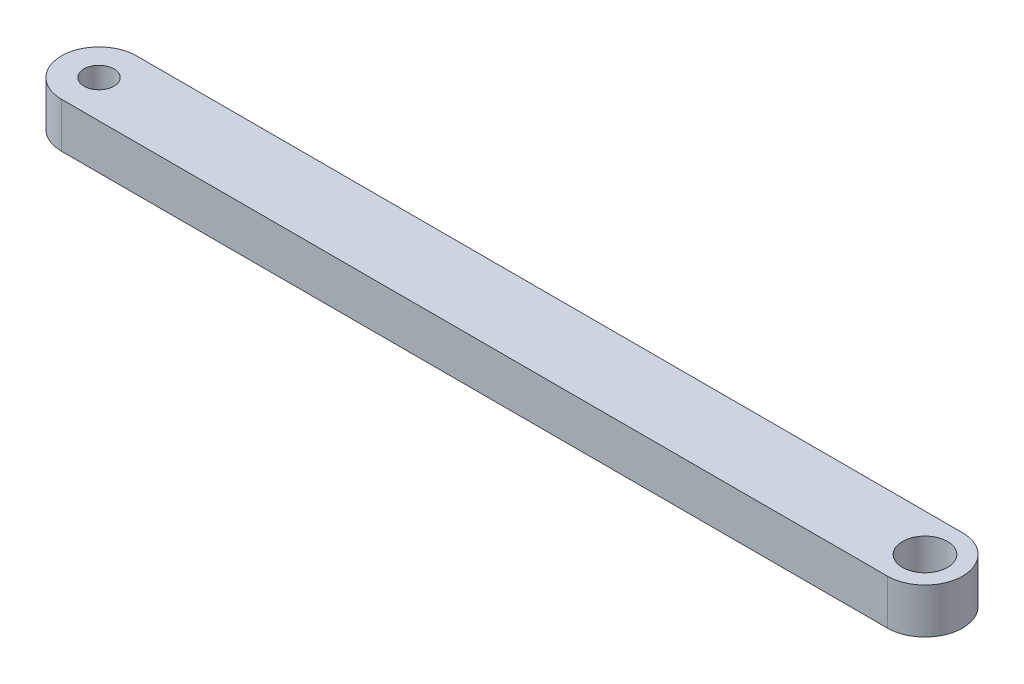
ISO-10303-21;
HEADER;
FILE_DESCRIPTION(('STEP AP214'),'2;1');
FILE_NAME('part.step','',(''),(''),'','','');
FILE_SCHEMA(('AUTOMOTIVE_DESIGN { 1 0 10303 214 1 1 1 1 }'));
ENDSEC;
DATA;
#1=APPLICATION_CONTEXT('core data for automotive mechanical design processes');
#2=APPLICATION_PROTOCOL_DEFINITION('international standard','automotive_design',2000,#1);
#3=PRODUCT_CONTEXT('',#1,'mechanical');
#4=PRODUCT('Part','Part','',(#3));
#5=PRODUCT_RELATED_PRODUCT_CATEGORY('part','',(#4));
#6=PRODUCT_DEFINITION_FORMATION('','',#4);
#7=PRODUCT_DEFINITION_CONTEXT('part definition',#1,'design');
#8=PRODUCT_DEFINITION('design','',#6,#7);
#9=PRODUCT_DEFINITION_SHAPE('','',#8);
#10=(LENGTH_UNIT() NAMED_UNIT(*) SI_UNIT(.MILLI.,.METRE.));
#11=(NAMED_UNIT(*) PLANE_ANGLE_UNIT() SI_UNIT($,.RADIAN.));
#12=(NAMED_UNIT(*) SI_UNIT($,.STERADIAN.) SOLID_ANGLE_UNIT());
#13=UNCERTAINTY_MEASURE_WITH_UNIT(LENGTH_MEASURE(1.E-05),#10,'distance_accuracy_value','');
#14=(GEOMETRIC_REPRESENTATION_CONTEXT(3) GLOBAL_UNCERTAINTY_ASSIGNED_CONTEXT((#13)) GLOBAL_UNIT_ASSIGNED_CONTEXT((#10,
#11,#12)) REPRESENTATION_CONTEXT('',''));
#15=CARTESIAN_POINT('',(0.,0.,0.));
#16=DIRECTION('',(0.,0.,1.));
#17=DIRECTION('',(1.,0.,0.));
#18=AXIS2_PLACEMENT_3D('',#15,#16,#17);
#19=CARTESIAN_POINT('',(46.,3.,0.));
#20=DIRECTION('',(0.,-1.,0.));
#21=DIRECTION('',(0.,0.,-1.));
#22=AXIS2_PLACEMENT_3D('',#19,#20,#21);
#23=CYLINDRICAL_SURFACE('',#22,2.5);
#24=CARTESIAN_POINT('',(46.,0.,0.));
#25=DIRECTION('',(0.,-1.,0.));
#26=DIRECTION('',(0.,0.,-1.));
#27=AXIS2_PLACEMENT_3D('',#24,#25,#26);
#28=CIRCLE('',#27,2.5);
#29=CARTESIAN_POINT('',(46.,0.,-2.5));
#30=VERTEX_POINT('',#29);
#31=CARTESIAN_POINT('',(46.,0.,2.5));
#32=VERTEX_POINT('',#31);
#33=EDGE_CURVE('E98',#30,#32,#28,.T.);
#34=ORIENTED_EDGE('',*,*,#33,.F.);
#35=DIRECTION('',(0.,-1.,0.));
#36=VECTOR('',#35,1.);
#37=CARTESIAN_POINT('',(46.,3.,-2.5));
#38=LINE('',#37,#36);
#39=CARTESIAN_POINT('',(46.,3.,-2.5));
#40=VERTEX_POINT('',#39);
#41=EDGE_CURVE('E11',#40,#30,#38,.T.);
#42=ORIENTED_EDGE('',*,*,#41,.F.);
#43=CARTESIAN_POINT('',(46.,3.,0.));
#44=DIRECTION('',(0.,-1.,0.));
#45=DIRECTION('',(0.,0.,-1.));
#46=AXIS2_PLACEMENT_3D('',#43,#44,#45);
#47=CIRCLE('',#46,2.5);
#48=CARTESIAN_POINT('',(46.,3.,2.5));
#49=VERTEX_POINT('',#48);
#50=EDGE_CURVE('E91',#40,#49,#47,.T.);
#51=ORIENTED_EDGE('',*,*,#50,.T.);
#52=DIRECTION('',(0.,-1.,0.));
#53=VECTOR('',#52,1.);
#54=CARTESIAN_POINT('',(46.,3.,2.5));
#55=LINE('',#54,#53);
#56=EDGE_CURVE('E36',#49,#32,#55,.T.);
#57=ORIENTED_EDGE('',*,*,#56,.T.);
#58=EDGE_LOOP('',(#34,#42,#51,#57));
#59=FACE_BOUND('',#58,.T.);
#60=ADVANCED_FACE('F33',(#59),#23,.T.);
#61=CARTESIAN_POINT('',(-9.00000000000001,3.,-2.5));
#62=DIRECTION('',(0.,0.,-1.));
#63=DIRECTION('',(-1.,0.,0.));
#64=AXIS2_PLACEMENT_3D('',#61,#62,#63);
#65=PLANE('',#64);
#66=DIRECTION('',(1.,0.,0.));
#67=VECTOR('',#66,1.);
#68=CARTESIAN_POINT('',(-9.00000000000001,0.,-2.5));
#69=LINE('',#68,#67);
#70=CARTESIAN_POINT('',(-9.,0.,-2.5));
#71=VERTEX_POINT('',#70);
#72=EDGE_CURVE('E93',#71,#30,#69,.T.);
#73=ORIENTED_EDGE('',*,*,#72,.F.);
#74=DIRECTION('',(0.,-1.,0.));
#75=VECTOR('',#74,1.);
#76=CARTESIAN_POINT('',(-9.,3.,-2.5));
#77=LINE('',#76,#75);
#78=CARTESIAN_POINT('',(-9.,3.,-2.5));
#79=VERTEX_POINT('',#78);
#80=EDGE_CURVE('E42',#79,#71,#77,.T.);
#81=ORIENTED_EDGE('',*,*,#80,.F.);
#82=DIRECTION('',(1.,0.,0.));
#83=VECTOR('',#82,1.);
#84=CARTESIAN_POINT('',(-9.00000000000001,3.,-2.5));
#85=LINE('',#84,#83);
#86=EDGE_CURVE('E88',#79,#40,#85,.T.);
#87=ORIENTED_EDGE('',*,*,#86,.T.);
#88=ORIENTED_EDGE('',*,*,#41,.T.);
#89=EDGE_LOOP('',(#73,#81,#87,#88));
#90=FACE_BOUND('',#89,.T.);
#91=ADVANCED_FACE('F109',(#90),#65,.T.);
#92=CARTESIAN_POINT('',(-9.,3.,0.));
#93=DIRECTION('',(0.,-1.,0.));
#94=DIRECTION('',(0.,0.,-1.));
#95=AXIS2_PLACEMENT_3D('',#92,#93,#94);
#96=CYLINDRICAL_SURFACE('',#95,2.5);
#97=CARTESIAN_POINT('',(-9.,0.,0.));
#98=DIRECTION('',(0.,-1.,0.));
#99=DIRECTION('',(0.,0.,-1.));
#100=AXIS2_PLACEMENT_3D('',#97,#98,#99);
#101=CIRCLE('',#100,2.5);
#102=CARTESIAN_POINT('',(-9.,0.,2.5));
#103=VERTEX_POINT('',#102);
#104=EDGE_CURVE('E83',#103,#71,#101,.T.);
#105=ORIENTED_EDGE('',*,*,#104,.F.);
#106=DIRECTION('',(0.,-1.,0.));
#107=VECTOR('',#106,1.);
#108=CARTESIAN_POINT('',(-9.,3.,2.5));
#109=LINE('',#108,#107);
#110=CARTESIAN_POINT('',(-9.,3.,2.5));
#111=VERTEX_POINT('',#110);
#112=EDGE_CURVE('E78',#111,#103,#109,.T.);
#113=ORIENTED_EDGE('',*,*,#112,.F.);
#114=CARTESIAN_POINT('',(-9.,3.,0.));
#115=DIRECTION('',(0.,-1.,0.));
#116=DIRECTION('',(0.,0.,-1.));
#117=AXIS2_PLACEMENT_3D('',#114,#115,#116);
#118=CIRCLE('',#117,2.5);
#119=EDGE_CURVE('E81',#111,#79,#118,.T.);
#120=ORIENTED_EDGE('',*,*,#119,.T.);
#121=ORIENTED_EDGE('',*,*,#80,.T.);
#122=EDGE_LOOP('',(#105,#113,#120,#121));
#123=FACE_BOUND('',#122,.T.);
#124=ADVANCED_FACE('F80',(#123),#96,.T.);
#125=CARTESIAN_POINT('',(46.,3.,2.5));
#126=DIRECTION('',(0.,0.,1.));
#127=DIRECTION('',(1.,0.,0.));
#128=AXIS2_PLACEMENT_3D('',#125,#126,#127);
#129=PLANE('',#128);
#130=DIRECTION('',(-1.,0.,0.));
#131=VECTOR('',#130,1.);
#132=CARTESIAN_POINT('',(46.,0.,2.5));
#133=LINE('',#132,#131);
#134=EDGE_CURVE('E101',#32,#103,#133,.T.);
#135=ORIENTED_EDGE('',*,*,#134,.F.);
#136=ORIENTED_EDGE('',*,*,#56,.F.);
#137=DIRECTION('',(-1.,0.,0.));
#138=VECTOR('',#137,1.);
#139=CARTESIAN_POINT('',(46.,3.,2.5));
#140=LINE('',#139,#138);
#141=EDGE_CURVE('E87',#49,#111,#140,.T.);
#142=ORIENTED_EDGE('',*,*,#141,.T.);
#143=ORIENTED_EDGE('',*,*,#112,.T.);
#144=EDGE_LOOP('',(#135,#136,#142,#143));
#145=FACE_BOUND('',#144,.T.);
#146=ADVANCED_FACE('F90',(#145),#129,.T.);
#147=CARTESIAN_POINT('',(46.,3.,0.));
#148=DIRECTION('',(0.,-1.,0.));
#149=DIRECTION('',(0.,0.,-1.));
#150=AXIS2_PLACEMENT_3D('',#147,#148,#149);
#151=PLANE('',#150);
#152=CARTESIAN_POINT('',(-9.,3.,0.));
#153=DIRECTION('',(0.,-1.,0.));
#154=DIRECTION('',(0.,0.,1.));
#155=AXIS2_PLACEMENT_3D('',#152,#153,#154);
#156=CIRCLE('',#155,1.);
#157=CARTESIAN_POINT('',(-9.,3.,1.));
#158=VERTEX_POINT('',#157);
#159=EDGE_CURVE('E142',#158,#158,#156,.T.);
#160=ORIENTED_EDGE('',*,*,#159,.T.);
#161=EDGE_LOOP('',(#160));
#162=FACE_BOUND('',#161,.T.);
#163=CARTESIAN_POINT('',(46.,3.,0.));
#164=DIRECTION('',(0.,-1.,0.));
#165=DIRECTION('',(0.,0.,1.));
#166=AXIS2_PLACEMENT_3D('',#163,#164,#165);
#167=CIRCLE('',#166,1.49999999999998);
#168=CARTESIAN_POINT('',(46.,3.,1.49999999999998));
#169=VERTEX_POINT('',#168);
#170=EDGE_CURVE('E102',#169,#169,#167,.T.);
#171=ORIENTED_EDGE('',*,*,#170,.T.);
#172=EDGE_LOOP('',(#171));
#173=FACE_BOUND('',#172,.T.);
#174=ORIENTED_EDGE('',*,*,#50,.F.);
#175=ORIENTED_EDGE('',*,*,#86,.F.);
#176=ORIENTED_EDGE('',*,*,#119,.F.);
#177=ORIENTED_EDGE('',*,*,#141,.F.);
#178=EDGE_LOOP('',(#174,#175,#176,#177));
#179=FACE_BOUND('',#178,.T.);
#180=ADVANCED_FACE('F86',(#162,#173,#179),#151,.F.);
#181=CARTESIAN_POINT('',(46.,0.,0.));
#182=DIRECTION('',(0.,-1.,0.));
#183=DIRECTION('',(0.,0.,-1.));
#184=AXIS2_PLACEMENT_3D('',#181,#182,#183);
#185=PLANE('',#184);
#186=CARTESIAN_POINT('',(-9.,0.,0.));
#187=DIRECTION('',(0.,-1.,0.));
#188=DIRECTION('',(0.,0.,1.));
#189=AXIS2_PLACEMENT_3D('',#186,#187,#188);
#190=CIRCLE('',#189,1.);
#191=CARTESIAN_POINT('',(-9.,0.,1.));
#192=VERTEX_POINT('',#191);
#193=EDGE_CURVE('E145',#192,#192,#190,.T.);
#194=ORIENTED_EDGE('',*,*,#193,.F.);
#195=EDGE_LOOP('',(#194));
#196=FACE_BOUND('',#195,.T.);
#197=CARTESIAN_POINT('',(46.,0.,0.));
#198=DIRECTION('',(0.,-1.,0.));
#199=DIRECTION('',(0.,0.,1.));
#200=AXIS2_PLACEMENT_3D('',#197,#198,#199);
#201=CIRCLE('',#200,1.49999999999998);
#202=CARTESIAN_POINT('',(46.,0.,1.49999999999998));
#203=VERTEX_POINT('',#202);
#204=EDGE_CURVE('E147',#203,#203,#201,.T.);
#205=ORIENTED_EDGE('',*,*,#204,.F.);
#206=EDGE_LOOP('',(#205));
#207=FACE_BOUND('',#206,.T.);
#208=ORIENTED_EDGE('',*,*,#33,.T.);
#209=ORIENTED_EDGE('',*,*,#134,.T.);
#210=ORIENTED_EDGE('',*,*,#104,.T.);
#211=ORIENTED_EDGE('',*,*,#72,.T.);
#212=EDGE_LOOP('',(#208,#209,#210,#211));
#213=FACE_BOUND('',#212,.T.);
#214=ADVANCED_FACE('F108',(#196,#207,#213),#185,.T.);
#215=CARTESIAN_POINT('',(46.,3.,0.));
#216=DIRECTION('',(0.,-1.,0.));
#217=DIRECTION('',(0.,0.,-1.));
#218=AXIS2_PLACEMENT_3D('',#215,#216,#217);
#219=CYLINDRICAL_SURFACE('',#218,1.49999999999998);
#220=ORIENTED_EDGE('',*,*,#170,.F.);
#221=EDGE_LOOP('',(#220));
#222=FACE_BOUND('',#221,.T.);
#223=ORIENTED_EDGE('',*,*,#204,.T.);
#224=EDGE_LOOP('',(#223));
#225=FACE_BOUND('',#224,.T.);
#226=ADVANCED_FACE('F127',(#222,#225),#219,.F.);
#227=CARTESIAN_POINT('',(-9.,3.,0.));
#228=DIRECTION('',(0.,-1.,0.));
#229=DIRECTION('',(0.,0.,-1.));
#230=AXIS2_PLACEMENT_3D('',#227,#228,#229);
#231=CYLINDRICAL_SURFACE('',#230,1.);
#232=ORIENTED_EDGE('',*,*,#159,.F.);
#233=EDGE_LOOP('',(#232));
#234=FACE_BOUND('',#233,.T.);
#235=ORIENTED_EDGE('',*,*,#193,.T.);
#236=EDGE_LOOP('',(#235));
#237=FACE_BOUND('',#236,.T.);
#238=ADVANCED_FACE('F134',(#234,#237),#231,.F.);
#239=CLOSED_SHELL('',(#60,#91,#124,#146,#180,#214,#226,#238));
#240=MANIFOLD_SOLID_BREP('B2',#239);
#241=ADVANCED_BREP_SHAPE_REPRESENTATION('',(#18,#240),#14);
#242=SHAPE_DEFINITION_REPRESENTATION(#9,#241);
ENDSEC;
END-ISO-10303-21;
